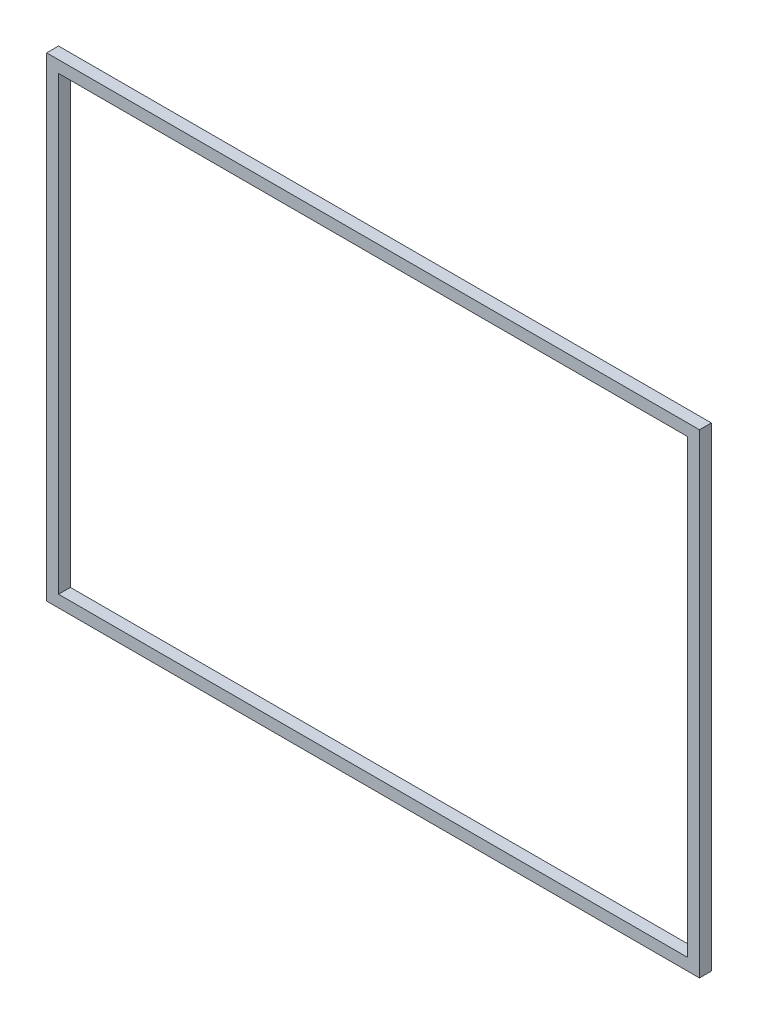
ISO-10303-21;
HEADER;
FILE_DESCRIPTION(('STEP AP214'),'2;1');
FILE_NAME('part.step','',(''),(''),'','','');
FILE_SCHEMA(('AUTOMOTIVE_DESIGN { 1 0 10303 214 1 1 1 1 }'));
ENDSEC;
DATA;
#1=APPLICATION_CONTEXT('core data for automotive mechanical design processes');
#2=APPLICATION_PROTOCOL_DEFINITION('international standard','automotive_design',2000,#1);
#3=PRODUCT_CONTEXT('',#1,'mechanical');
#4=PRODUCT('Part','Part','',(#3));
#5=PRODUCT_RELATED_PRODUCT_CATEGORY('part','',(#4));
#6=PRODUCT_DEFINITION_FORMATION('','',#4);
#7=PRODUCT_DEFINITION_CONTEXT('part definition',#1,'design');
#8=PRODUCT_DEFINITION('design','',#6,#7);
#9=PRODUCT_DEFINITION_SHAPE('','',#8);
#10=(LENGTH_UNIT() NAMED_UNIT(*) SI_UNIT(.MILLI.,.METRE.));
#11=(NAMED_UNIT(*) PLANE_ANGLE_UNIT() SI_UNIT($,.RADIAN.));
#12=(NAMED_UNIT(*) SI_UNIT($,.STERADIAN.) SOLID_ANGLE_UNIT());
#13=UNCERTAINTY_MEASURE_WITH_UNIT(LENGTH_MEASURE(1.E-05),#10,'distance_accuracy_value','');
#14=(GEOMETRIC_REPRESENTATION_CONTEXT(3) GLOBAL_UNCERTAINTY_ASSIGNED_CONTEXT((#13)) GLOBAL_UNIT_ASSIGNED_CONTEXT((#10,
#11,#12)) REPRESENTATION_CONTEXT('',''));
#15=CARTESIAN_POINT('',(0.,0.,0.));
#16=DIRECTION('',(0.,0.,1.));
#17=DIRECTION('',(1.,0.,0.));
#18=AXIS2_PLACEMENT_3D('',#15,#16,#17);
#19=CARTESIAN_POINT('',(72.0651626706937,57.903326474608,-39.1));
#20=DIRECTION('',(0.,0.,-1.));
#21=DIRECTION('',(-1.,0.,0.));
#22=AXIS2_PLACEMENT_3D('',#19,#20,#21);
#23=PLANE('',#22);
#24=DIRECTION('',(1.,0.,0.));
#25=VECTOR('',#24,1.);
#26=CARTESIAN_POINT('',(66.5651626706937,61.903326474608,-39.1));
#27=LINE('',#26,#25);
#28=CARTESIAN_POINT('',(66.5651626706937,61.903326474608,-39.1));
#29=VERTEX_POINT('',#28);
#30=CARTESIAN_POINT('',(72.0651626706937,61.903326474608,-39.1));
#31=VERTEX_POINT('',#30);
#32=EDGE_CURVE('E123',#29,#31,#27,.T.);
#33=ORIENTED_EDGE('',*,*,#32,.T.);
#34=DIRECTION('',(0.,1.,0.));
#35=VECTOR('',#34,1.);
#36=CARTESIAN_POINT('',(72.0651626706937,61.903326474608,-39.1));
#37=LINE('',#36,#35);
#38=CARTESIAN_POINT('',(72.0651626706937,57.903326474608,-39.1));
#39=VERTEX_POINT('',#38);
#40=EDGE_CURVE('E110',#31,#39,#37,.F.);
#41=ORIENTED_EDGE('',*,*,#40,.T.);
#42=DIRECTION('',(1.,0.,0.));
#43=VECTOR('',#42,1.);
#44=CARTESIAN_POINT('',(72.0651626706937,57.903326474608,-39.1));
#45=LINE('',#44,#43);
#46=CARTESIAN_POINT('',(66.5651626706937,57.903326474608,-39.1));
#47=VERTEX_POINT('',#46);
#48=EDGE_CURVE('E115',#39,#47,#45,.F.);
#49=ORIENTED_EDGE('',*,*,#48,.T.);
#50=DIRECTION('',(0.,1.,0.));
#51=VECTOR('',#50,1.);
#52=CARTESIAN_POINT('',(66.5651626706937,57.903326474608,-39.1));
#53=LINE('',#52,#51);
#54=EDGE_CURVE('E120',#47,#29,#53,.T.);
#55=ORIENTED_EDGE('',*,*,#54,.T.);
#56=EDGE_LOOP('',(#33,#41,#49,#55));
#57=FACE_BOUND('',#56,.T.);
#58=DIRECTION('',(0.,1.,0.));
#59=VECTOR('',#58,1.);
#60=CARTESIAN_POINT('',(71.9651626706937,61.903326474608,-39.1));
#61=LINE('',#60,#59);
#62=CARTESIAN_POINT('',(71.9651626706937,61.803326474608,-39.1));
#63=VERTEX_POINT('',#62);
#64=CARTESIAN_POINT('',(71.9651626706937,58.003326474608,-39.1));
#65=VERTEX_POINT('',#64);
#66=EDGE_CURVE('E84',#63,#65,#61,.F.);
#67=ORIENTED_EDGE('',*,*,#66,.F.);
#68=DIRECTION('',(1.,0.,0.));
#69=VECTOR('',#68,1.);
#70=CARTESIAN_POINT('',(66.5651626706937,61.803326474608,-39.1));
#71=LINE('',#70,#69);
#72=CARTESIAN_POINT('',(66.6651626706937,61.803326474608,-39.1));
#73=VERTEX_POINT('',#72);
#74=EDGE_CURVE('E79',#73,#63,#71,.T.);
#75=ORIENTED_EDGE('',*,*,#74,.F.);
#76=DIRECTION('',(0.,1.,0.));
#77=VECTOR('',#76,1.);
#78=CARTESIAN_POINT('',(66.6651626706937,57.903326474608,-39.1));
#79=LINE('',#78,#77);
#80=CARTESIAN_POINT('',(66.6651626706937,58.003326474608,-39.1));
#81=VERTEX_POINT('',#80);
#82=EDGE_CURVE('E94',#81,#73,#79,.T.);
#83=ORIENTED_EDGE('',*,*,#82,.F.);
#84=DIRECTION('',(1.,0.,0.));
#85=VECTOR('',#84,1.);
#86=CARTESIAN_POINT('',(72.0651626706937,58.003326474608,-39.1));
#87=LINE('',#86,#85);
#88=EDGE_CURVE('E20',#65,#81,#87,.F.);
#89=ORIENTED_EDGE('',*,*,#88,.F.);
#90=EDGE_LOOP('',(#67,#75,#83,#89));
#91=FACE_BOUND('',#90,.T.);
#92=ADVANCED_FACE('F17',(#57,#91),#23,.T.);
#93=CARTESIAN_POINT('',(72.0651626706937,58.003326474608,-39.1));
#94=DIRECTION('',(0.,1.,0.));
#95=DIRECTION('',(0.,0.,1.));
#96=AXIS2_PLACEMENT_3D('',#93,#94,#95);
#97=PLANE('',#96);
#98=ORIENTED_EDGE('',*,*,#88,.T.);
#99=DIRECTION('',(0.,0.,-1.));
#100=VECTOR('',#99,1.);
#101=CARTESIAN_POINT('',(66.6651626706937,58.003326474608,-39.1));
#102=LINE('',#101,#100);
#103=CARTESIAN_POINT('',(66.6651626706937,58.003326474608,-39.));
#104=VERTEX_POINT('',#103);
#105=EDGE_CURVE('E105',#104,#81,#102,.T.);
#106=ORIENTED_EDGE('',*,*,#105,.F.);
#107=DIRECTION('',(-1.,0.,0.));
#108=VECTOR('',#107,1.);
#109=CARTESIAN_POINT('',(66.5651626706937,58.003326474608,-39.));
#110=LINE('',#109,#108);
#111=CARTESIAN_POINT('',(71.9651626706937,58.003326474608,-39.));
#112=VERTEX_POINT('',#111);
#113=EDGE_CURVE('E100',#104,#112,#110,.F.);
#114=ORIENTED_EDGE('',*,*,#113,.T.);
#115=DIRECTION('',(0.,0.,1.));
#116=VECTOR('',#115,1.);
#117=CARTESIAN_POINT('',(71.9651626706937,58.003326474608,-39.1));
#118=LINE('',#117,#116);
#119=EDGE_CURVE('E89',#65,#112,#118,.T.);
#120=ORIENTED_EDGE('',*,*,#119,.F.);
#121=EDGE_LOOP('',(#98,#106,#114,#120));
#122=FACE_BOUND('',#121,.T.);
#123=ADVANCED_FACE('F99',(#122),#97,.T.);
#124=CARTESIAN_POINT('',(71.9651626706937,61.903326474608,-39.1));
#125=DIRECTION('',(-1.,0.,0.));
#126=DIRECTION('',(0.,0.,1.));
#127=AXIS2_PLACEMENT_3D('',#124,#125,#126);
#128=PLANE('',#127);
#129=ORIENTED_EDGE('',*,*,#66,.T.);
#130=ORIENTED_EDGE('',*,*,#119,.T.);
#131=DIRECTION('',(0.,1.,0.));
#132=VECTOR('',#131,1.);
#133=CARTESIAN_POINT('',(71.9651626706937,61.903326474608,-39.));
#134=LINE('',#133,#132);
#135=CARTESIAN_POINT('',(71.9651626706937,61.803326474608,-39.));
#136=VERTEX_POINT('',#135);
#137=EDGE_CURVE('E130',#112,#136,#134,.T.);
#138=ORIENTED_EDGE('',*,*,#137,.T.);
#139=DIRECTION('',(0.,0.,-1.));
#140=VECTOR('',#139,1.);
#141=CARTESIAN_POINT('',(71.9651626706937,61.803326474608,-39.1));
#142=LINE('',#141,#140);
#143=EDGE_CURVE('E91',#63,#136,#142,.F.);
#144=ORIENTED_EDGE('',*,*,#143,.F.);
#145=EDGE_LOOP('',(#129,#130,#138,#144));
#146=FACE_BOUND('',#145,.T.);
#147=ADVANCED_FACE('F86',(#146),#128,.T.);
#148=CARTESIAN_POINT('',(66.5651626706937,61.803326474608,-39.1));
#149=DIRECTION('',(0.,-1.,0.));
#150=DIRECTION('',(0.,0.,-1.));
#151=AXIS2_PLACEMENT_3D('',#148,#149,#150);
#152=PLANE('',#151);
#153=ORIENTED_EDGE('',*,*,#74,.T.);
#154=ORIENTED_EDGE('',*,*,#143,.T.);
#155=DIRECTION('',(-1.,0.,0.));
#156=VECTOR('',#155,1.);
#157=CARTESIAN_POINT('',(66.5651626706937,61.803326474608,-39.));
#158=LINE('',#157,#156);
#159=CARTESIAN_POINT('',(66.6651626706937,61.803326474608,-39.));
#160=VERTEX_POINT('',#159);
#161=EDGE_CURVE('E132',#136,#160,#158,.T.);
#162=ORIENTED_EDGE('',*,*,#161,.T.);
#163=DIRECTION('',(0.,0.,-1.));
#164=VECTOR('',#163,1.);
#165=CARTESIAN_POINT('',(66.6651626706937,61.803326474608,-39.1));
#166=LINE('',#165,#164);
#167=EDGE_CURVE('E108',#73,#160,#166,.F.);
#168=ORIENTED_EDGE('',*,*,#167,.F.);
#169=EDGE_LOOP('',(#153,#154,#162,#168));
#170=FACE_BOUND('',#169,.T.);
#171=ADVANCED_FACE('F177',(#170),#152,.T.);
#172=CARTESIAN_POINT('',(66.6651626706937,57.903326474608,-39.1));
#173=DIRECTION('',(1.,0.,0.));
#174=DIRECTION('',(0.,0.,-1.));
#175=AXIS2_PLACEMENT_3D('',#172,#173,#174);
#176=PLANE('',#175);
#177=ORIENTED_EDGE('',*,*,#82,.T.);
#178=ORIENTED_EDGE('',*,*,#167,.T.);
#179=DIRECTION('',(0.,1.,0.));
#180=VECTOR('',#179,1.);
#181=CARTESIAN_POINT('',(66.6651626706937,61.903326474608,-39.));
#182=LINE('',#181,#180);
#183=EDGE_CURVE('E135',#160,#104,#182,.F.);
#184=ORIENTED_EDGE('',*,*,#183,.T.);
#185=ORIENTED_EDGE('',*,*,#105,.T.);
#186=EDGE_LOOP('',(#177,#178,#184,#185));
#187=FACE_BOUND('',#186,.T.);
#188=ADVANCED_FACE('F174',(#187),#176,.T.);
#189=CARTESIAN_POINT('',(72.0651626706937,61.903326474608,-39.1));
#190=DIRECTION('',(-1.,0.,0.));
#191=DIRECTION('',(0.,0.,1.));
#192=AXIS2_PLACEMENT_3D('',#189,#190,#191);
#193=PLANE('',#192);
#194=DIRECTION('',(0.,0.,1.));
#195=VECTOR('',#194,1.);
#196=CARTESIAN_POINT('',(72.0651626706937,57.903326474608,-39.1));
#197=LINE('',#196,#195);
#198=CARTESIAN_POINT('',(72.0651626706937,57.903326474608,-39.));
#199=VERTEX_POINT('',#198);
#200=EDGE_CURVE('E112',#199,#39,#197,.F.);
#201=ORIENTED_EDGE('',*,*,#200,.T.);
#202=ORIENTED_EDGE('',*,*,#40,.F.);
#203=DIRECTION('',(0.,0.,-1.));
#204=VECTOR('',#203,1.);
#205=CARTESIAN_POINT('',(72.0651626706937,61.903326474608,-39.1));
#206=LINE('',#205,#204);
#207=CARTESIAN_POINT('',(72.0651626706937,61.903326474608,-39.));
#208=VERTEX_POINT('',#207);
#209=EDGE_CURVE('E126',#31,#208,#206,.F.);
#210=ORIENTED_EDGE('',*,*,#209,.T.);
#211=DIRECTION('',(0.,1.,0.));
#212=VECTOR('',#211,1.);
#213=CARTESIAN_POINT('',(72.0651626706937,61.903326474608,-39.));
#214=LINE('',#213,#212);
#215=EDGE_CURVE('E138',#208,#199,#214,.F.);
#216=ORIENTED_EDGE('',*,*,#215,.T.);
#217=EDGE_LOOP('',(#201,#202,#210,#216));
#218=FACE_BOUND('',#217,.T.);
#219=ADVANCED_FACE('F157',(#218),#193,.F.);
#220=CARTESIAN_POINT('',(72.0651626706937,57.903326474608,-39.1));
#221=DIRECTION('',(0.,1.,0.));
#222=DIRECTION('',(0.,0.,1.));
#223=AXIS2_PLACEMENT_3D('',#220,#221,#222);
#224=PLANE('',#223);
#225=DIRECTION('',(0.,0.,-1.));
#226=VECTOR('',#225,1.);
#227=CARTESIAN_POINT('',(66.5651626706937,57.903326474608,-39.1));
#228=LINE('',#227,#226);
#229=CARTESIAN_POINT('',(66.5651626706937,57.903326474608,-39.));
#230=VERTEX_POINT('',#229);
#231=EDGE_CURVE('E117',#230,#47,#228,.T.);
#232=ORIENTED_EDGE('',*,*,#231,.T.);
#233=ORIENTED_EDGE('',*,*,#48,.F.);
#234=ORIENTED_EDGE('',*,*,#200,.F.);
#235=DIRECTION('',(-1.,0.,0.));
#236=VECTOR('',#235,1.);
#237=CARTESIAN_POINT('',(66.5651626706937,57.903326474608,-39.));
#238=LINE('',#237,#236);
#239=EDGE_CURVE('E141',#199,#230,#238,.T.);
#240=ORIENTED_EDGE('',*,*,#239,.T.);
#241=EDGE_LOOP('',(#232,#233,#234,#240));
#242=FACE_BOUND('',#241,.T.);
#243=ADVANCED_FACE('F154',(#242),#224,.F.);
#244=CARTESIAN_POINT('',(66.5651626706937,57.903326474608,-39.1));
#245=DIRECTION('',(1.,0.,0.));
#246=DIRECTION('',(0.,0.,-1.));
#247=AXIS2_PLACEMENT_3D('',#244,#245,#246);
#248=PLANE('',#247);
#249=DIRECTION('',(0.,0.,-1.));
#250=VECTOR('',#249,1.);
#251=CARTESIAN_POINT('',(66.5651626706937,61.903326474608,-39.1));
#252=LINE('',#251,#250);
#253=CARTESIAN_POINT('',(66.5651626706937,61.903326474608,-39.));
#254=VERTEX_POINT('',#253);
#255=EDGE_CURVE('E34',#254,#29,#252,.T.);
#256=ORIENTED_EDGE('',*,*,#255,.T.);
#257=ORIENTED_EDGE('',*,*,#54,.F.);
#258=ORIENTED_EDGE('',*,*,#231,.F.);
#259=DIRECTION('',(0.,1.,0.));
#260=VECTOR('',#259,1.);
#261=CARTESIAN_POINT('',(66.5651626706937,61.903326474608,-39.));
#262=LINE('',#261,#260);
#263=EDGE_CURVE('E26',#230,#254,#262,.T.);
#264=ORIENTED_EDGE('',*,*,#263,.T.);
#265=EDGE_LOOP('',(#256,#257,#258,#264));
#266=FACE_BOUND('',#265,.T.);
#267=ADVANCED_FACE('F147',(#266),#248,.F.);
#268=CARTESIAN_POINT('',(66.5651626706937,61.903326474608,-39.1));
#269=DIRECTION('',(0.,-1.,0.));
#270=DIRECTION('',(0.,0.,-1.));
#271=AXIS2_PLACEMENT_3D('',#268,#269,#270);
#272=PLANE('',#271);
#273=ORIENTED_EDGE('',*,*,#209,.F.);
#274=ORIENTED_EDGE('',*,*,#32,.F.);
#275=ORIENTED_EDGE('',*,*,#255,.F.);
#276=DIRECTION('',(-1.,0.,0.));
#277=VECTOR('',#276,1.);
#278=CARTESIAN_POINT('',(66.5651626706937,61.903326474608,-39.));
#279=LINE('',#278,#277);
#280=EDGE_CURVE('E11',#254,#208,#279,.F.);
#281=ORIENTED_EDGE('',*,*,#280,.T.);
#282=EDGE_LOOP('',(#273,#274,#275,#281));
#283=FACE_BOUND('',#282,.T.);
#284=ADVANCED_FACE('F159',(#283),#272,.F.);
#285=CARTESIAN_POINT('',(66.5651626706937,61.903326474608,-39.));
#286=DIRECTION('',(0.,0.,-1.));
#287=DIRECTION('',(-1.,0.,0.));
#288=AXIS2_PLACEMENT_3D('',#285,#286,#287);
#289=PLANE('',#288);
#290=ORIENTED_EDGE('',*,*,#263,.F.);
#291=ORIENTED_EDGE('',*,*,#239,.F.);
#292=ORIENTED_EDGE('',*,*,#215,.F.);
#293=ORIENTED_EDGE('',*,*,#280,.F.);
#294=EDGE_LOOP('',(#290,#291,#292,#293));
#295=FACE_BOUND('',#294,.T.);
#296=ORIENTED_EDGE('',*,*,#161,.F.);
#297=ORIENTED_EDGE('',*,*,#137,.F.);
#298=ORIENTED_EDGE('',*,*,#113,.F.);
#299=ORIENTED_EDGE('',*,*,#183,.F.);
#300=EDGE_LOOP('',(#296,#297,#298,#299));
#301=FACE_BOUND('',#300,.T.);
#302=ADVANCED_FACE('F151',(#295,#301),#289,.F.);
#303=CLOSED_SHELL('',(#92,#123,#147,#171,#188,#219,#243,#267,#284,#302));
#304=MANIFOLD_SOLID_BREP('B1',#303);
#305=ADVANCED_BREP_SHAPE_REPRESENTATION('',(#18,#304),#14);
#306=SHAPE_DEFINITION_REPRESENTATION(#9,#305);
ENDSEC;
END-ISO-10303-21;
